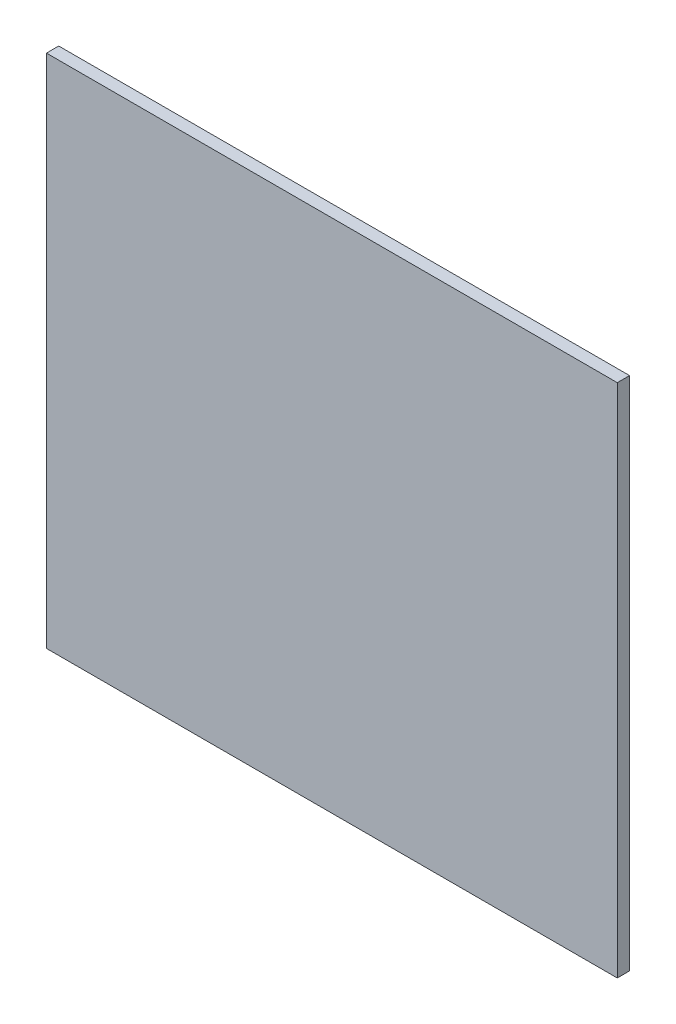
ISO-10303-21;
HEADER;
FILE_DESCRIPTION(('STEP AP214'),'2;1');
FILE_NAME('part.step','',(''),(''),'','','');
FILE_SCHEMA(('AUTOMOTIVE_DESIGN { 1 0 10303 214 1 1 1 1 }'));
ENDSEC;
DATA;
#1=APPLICATION_CONTEXT('core data for automotive mechanical design processes');
#2=APPLICATION_PROTOCOL_DEFINITION('international standard','automotive_design',2000,#1);
#3=PRODUCT_CONTEXT('',#1,'mechanical');
#4=PRODUCT('Part','Part','',(#3));
#5=PRODUCT_RELATED_PRODUCT_CATEGORY('part','',(#4));
#6=PRODUCT_DEFINITION_FORMATION('','',#4);
#7=PRODUCT_DEFINITION_CONTEXT('part definition',#1,'design');
#8=PRODUCT_DEFINITION('design','',#6,#7);
#9=PRODUCT_DEFINITION_SHAPE('','',#8);
#10=(LENGTH_UNIT() NAMED_UNIT(*) SI_UNIT(.MILLI.,.METRE.));
#11=(NAMED_UNIT(*) PLANE_ANGLE_UNIT() SI_UNIT($,.RADIAN.));
#12=(NAMED_UNIT(*) SI_UNIT($,.STERADIAN.) SOLID_ANGLE_UNIT());
#13=UNCERTAINTY_MEASURE_WITH_UNIT(LENGTH_MEASURE(1.E-05),#10,'distance_accuracy_value','');
#14=(GEOMETRIC_REPRESENTATION_CONTEXT(3) GLOBAL_UNCERTAINTY_ASSIGNED_CONTEXT((#13)) GLOBAL_UNIT_ASSIGNED_CONTEXT((#10,
#11,#12)) REPRESENTATION_CONTEXT('',''));
#15=CARTESIAN_POINT('',(0.,0.,0.));
#16=DIRECTION('',(0.,0.,1.));
#17=DIRECTION('',(1.,0.,0.));
#18=AXIS2_PLACEMENT_3D('',#15,#16,#17);
#19=CARTESIAN_POINT('',(-46.5,47.7876634578614,2.));
#20=DIRECTION('',(1.,0.,0.));
#21=DIRECTION('',(0.,1.,0.));
#22=AXIS2_PLACEMENT_3D('',#19,#20,#21);
#23=PLANE('',#22);
#24=DIRECTION('',(0.,-1.,0.));
#25=VECTOR('',#24,1.);
#26=CARTESIAN_POINT('',(-46.5,47.7876634578614,0.));
#27=LINE('',#26,#25);
#28=CARTESIAN_POINT('',(-46.5,47.7876634578614,0.));
#29=VERTEX_POINT('',#28);
#30=CARTESIAN_POINT('',(-46.5,-36.2123365421386,0.));
#31=VERTEX_POINT('',#30);
#32=EDGE_CURVE('E111',#29,#31,#27,.T.);
#33=ORIENTED_EDGE('',*,*,#32,.T.);
#34=DIRECTION('',(0.,0.,-1.));
#35=VECTOR('',#34,1.);
#36=CARTESIAN_POINT('',(-46.5,-36.2123365421386,2.));
#37=LINE('',#36,#35);
#38=CARTESIAN_POINT('',(-46.5,-36.2123365421386,2.));
#39=VERTEX_POINT('',#38);
#40=EDGE_CURVE('E11',#39,#31,#37,.T.);
#41=ORIENTED_EDGE('',*,*,#40,.F.);
#42=DIRECTION('',(0.,-1.,0.));
#43=VECTOR('',#42,1.);
#44=CARTESIAN_POINT('',(-46.5,47.7876634578614,2.));
#45=LINE('',#44,#43);
#46=CARTESIAN_POINT('',(-46.5,47.7876634578614,2.));
#47=VERTEX_POINT('',#46);
#48=EDGE_CURVE('E95',#47,#39,#45,.T.);
#49=ORIENTED_EDGE('',*,*,#48,.F.);
#50=DIRECTION('',(0.,0.,-1.));
#51=VECTOR('',#50,1.);
#52=CARTESIAN_POINT('',(-46.5,47.7876634578614,2.));
#53=LINE('',#52,#51);
#54=EDGE_CURVE('E107',#47,#29,#53,.T.);
#55=ORIENTED_EDGE('',*,*,#54,.T.);
#56=EDGE_LOOP('',(#33,#41,#49,#55));
#57=FACE_BOUND('',#56,.T.);
#58=ADVANCED_FACE('F43',(#57),#23,.F.);
#59=CARTESIAN_POINT('',(-46.5,-36.2123365421386,2.));
#60=DIRECTION('',(0.,1.,0.));
#61=DIRECTION('',(0.,0.,1.));
#62=AXIS2_PLACEMENT_3D('',#59,#60,#61);
#63=PLANE('',#62);
#64=DIRECTION('',(1.,0.,0.));
#65=VECTOR('',#64,1.);
#66=CARTESIAN_POINT('',(-46.5,-36.2123365421386,0.));
#67=LINE('',#66,#65);
#68=CARTESIAN_POINT('',(46.5,-36.2123365421386,0.));
#69=VERTEX_POINT('',#68);
#70=EDGE_CURVE('E100',#31,#69,#67,.T.);
#71=ORIENTED_EDGE('',*,*,#70,.T.);
#72=DIRECTION('',(0.,0.,-1.));
#73=VECTOR('',#72,1.);
#74=CARTESIAN_POINT('',(46.5,-36.2123365421386,2.));
#75=LINE('',#74,#73);
#76=CARTESIAN_POINT('',(46.5,-36.2123365421386,2.));
#77=VERTEX_POINT('',#76);
#78=EDGE_CURVE('E52',#77,#69,#75,.T.);
#79=ORIENTED_EDGE('',*,*,#78,.F.);
#80=DIRECTION('',(1.,0.,0.));
#81=VECTOR('',#80,1.);
#82=CARTESIAN_POINT('',(-46.5,-36.2123365421386,2.));
#83=LINE('',#82,#81);
#84=EDGE_CURVE('E90',#39,#77,#83,.T.);
#85=ORIENTED_EDGE('',*,*,#84,.F.);
#86=ORIENTED_EDGE('',*,*,#40,.T.);
#87=EDGE_LOOP('',(#71,#79,#85,#86));
#88=FACE_BOUND('',#87,.T.);
#89=ADVANCED_FACE('F99',(#88),#63,.F.);
#90=CARTESIAN_POINT('',(46.5,47.7876634578614,2.));
#91=DIRECTION('',(-1.,0.,0.));
#92=DIRECTION('',(0.,-1.,0.));
#93=AXIS2_PLACEMENT_3D('',#90,#91,#92);
#94=PLANE('',#93);
#95=DIRECTION('',(0.,1.,0.));
#96=VECTOR('',#95,1.);
#97=CARTESIAN_POINT('',(46.5,47.7876634578614,0.));
#98=LINE('',#97,#96);
#99=CARTESIAN_POINT('',(46.5,47.7876634578614,0.));
#100=VERTEX_POINT('',#99);
#101=EDGE_CURVE('E77',#69,#100,#98,.T.);
#102=ORIENTED_EDGE('',*,*,#101,.T.);
#103=DIRECTION('',(0.,0.,-1.));
#104=VECTOR('',#103,1.);
#105=CARTESIAN_POINT('',(46.5,47.7876634578614,2.));
#106=LINE('',#105,#104);
#107=CARTESIAN_POINT('',(46.5,47.7876634578614,2.));
#108=VERTEX_POINT('',#107);
#109=EDGE_CURVE('E102',#108,#100,#106,.T.);
#110=ORIENTED_EDGE('',*,*,#109,.F.);
#111=DIRECTION('',(0.,1.,0.));
#112=VECTOR('',#111,1.);
#113=CARTESIAN_POINT('',(46.5,47.7876634578614,2.));
#114=LINE('',#113,#112);
#115=EDGE_CURVE('E93',#77,#108,#114,.T.);
#116=ORIENTED_EDGE('',*,*,#115,.F.);
#117=ORIENTED_EDGE('',*,*,#78,.T.);
#118=EDGE_LOOP('',(#102,#110,#116,#117));
#119=FACE_BOUND('',#118,.T.);
#120=ADVANCED_FACE('F103',(#119),#94,.F.);
#121=CARTESIAN_POINT('',(-46.5,47.7876634578614,2.));
#122=DIRECTION('',(0.,-1.,0.));
#123=DIRECTION('',(0.,0.,-1.));
#124=AXIS2_PLACEMENT_3D('',#121,#122,#123);
#125=PLANE('',#124);
#126=DIRECTION('',(-1.,0.,0.));
#127=VECTOR('',#126,1.);
#128=CARTESIAN_POINT('',(-46.5,47.7876634578614,0.));
#129=LINE('',#128,#127);
#130=EDGE_CURVE('E83',#100,#29,#129,.T.);
#131=ORIENTED_EDGE('',*,*,#130,.T.);
#132=ORIENTED_EDGE('',*,*,#54,.F.);
#133=DIRECTION('',(-1.,0.,0.));
#134=VECTOR('',#133,1.);
#135=CARTESIAN_POINT('',(-46.5,47.7876634578614,2.));
#136=LINE('',#135,#134);
#137=EDGE_CURVE('E60',#108,#47,#136,.T.);
#138=ORIENTED_EDGE('',*,*,#137,.F.);
#139=ORIENTED_EDGE('',*,*,#109,.T.);
#140=EDGE_LOOP('',(#131,#132,#138,#139));
#141=FACE_BOUND('',#140,.T.);
#142=ADVANCED_FACE('F124',(#141),#125,.F.);
#143=CARTESIAN_POINT('',(0.,0.,2.));
#144=DIRECTION('',(0.,0.,1.));
#145=DIRECTION('',(1.,0.,0.));
#146=AXIS2_PLACEMENT_3D('',#143,#144,#145);
#147=PLANE('',#146);
#148=ORIENTED_EDGE('',*,*,#48,.T.);
#149=ORIENTED_EDGE('',*,*,#84,.T.);
#150=ORIENTED_EDGE('',*,*,#115,.T.);
#151=ORIENTED_EDGE('',*,*,#137,.T.);
#152=EDGE_LOOP('',(#148,#149,#150,#151));
#153=FACE_BOUND('',#152,.T.);
#154=ADVANCED_FACE('F91',(#153),#147,.T.);
#155=CARTESIAN_POINT('',(0.,0.,0.));
#156=DIRECTION('',(0.,0.,1.));
#157=DIRECTION('',(1.,0.,0.));
#158=AXIS2_PLACEMENT_3D('',#155,#156,#157);
#159=PLANE('',#158);
#160=ORIENTED_EDGE('',*,*,#32,.F.);
#161=ORIENTED_EDGE('',*,*,#130,.F.);
#162=ORIENTED_EDGE('',*,*,#101,.F.);
#163=ORIENTED_EDGE('',*,*,#70,.F.);
#164=EDGE_LOOP('',(#160,#161,#162,#163));
#165=FACE_BOUND('',#164,.T.);
#166=ADVANCED_FACE('F127',(#165),#159,.F.);
#167=CLOSED_SHELL('',(#58,#89,#120,#142,#154,#166));
#168=MANIFOLD_SOLID_BREP('B2',#167);
#169=ADVANCED_BREP_SHAPE_REPRESENTATION('',(#18,#168),#14);
#170=SHAPE_DEFINITION_REPRESENTATION(#9,#169);
ENDSEC;
END-ISO-10303-21;
